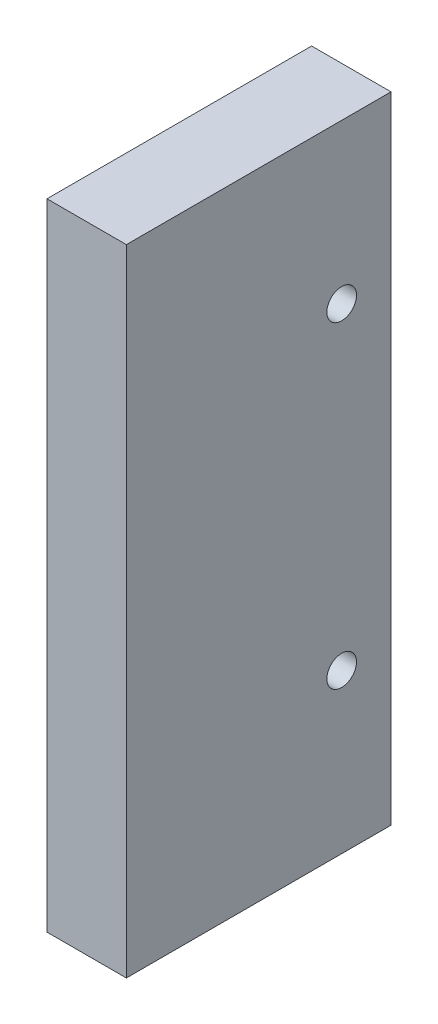
ISO-10303-21;
HEADER;
FILE_DESCRIPTION(('STEP AP214'),'2;1');
FILE_NAME('part.step','',(''),(''),'','','');
FILE_SCHEMA(('AUTOMOTIVE_DESIGN { 1 0 10303 214 1 1 1 1 }'));
ENDSEC;
DATA;
#1=APPLICATION_CONTEXT('core data for automotive mechanical design processes');
#2=APPLICATION_PROTOCOL_DEFINITION('international standard','automotive_design',2000,#1);
#3=PRODUCT_CONTEXT('',#1,'mechanical');
#4=PRODUCT('Part','Part','',(#3));
#5=PRODUCT_RELATED_PRODUCT_CATEGORY('part','',(#4));
#6=PRODUCT_DEFINITION_FORMATION('','',#4);
#7=PRODUCT_DEFINITION_CONTEXT('part definition',#1,'design');
#8=PRODUCT_DEFINITION('design','',#6,#7);
#9=PRODUCT_DEFINITION_SHAPE('','',#8);
#10=(LENGTH_UNIT() NAMED_UNIT(*) SI_UNIT(.MILLI.,.METRE.));
#11=(NAMED_UNIT(*) PLANE_ANGLE_UNIT() SI_UNIT($,.RADIAN.));
#12=(NAMED_UNIT(*) SI_UNIT($,.STERADIAN.) SOLID_ANGLE_UNIT());
#13=UNCERTAINTY_MEASURE_WITH_UNIT(LENGTH_MEASURE(1.E-05),#10,'distance_accuracy_value','');
#14=(GEOMETRIC_REPRESENTATION_CONTEXT(3) GLOBAL_UNCERTAINTY_ASSIGNED_CONTEXT((#13)) GLOBAL_UNIT_ASSIGNED_CONTEXT((#10,
#11,#12)) REPRESENTATION_CONTEXT('',''));
#15=CARTESIAN_POINT('',(0.,0.,0.));
#16=DIRECTION('',(0.,0.,1.));
#17=DIRECTION('',(1.,0.,0.));
#18=AXIS2_PLACEMENT_3D('',#15,#16,#17);
#19=CARTESIAN_POINT('',(0.,0.,31.75));
#20=DIRECTION('',(1.,0.,0.));
#21=DIRECTION('',(0.,0.,-1.));
#22=AXIS2_PLACEMENT_3D('',#19,#20,#21);
#23=PLANE('',#22);
#24=CARTESIAN_POINT('',(0.,19.05,5.91820000000001));
#25=DIRECTION('',(-1.,0.,0.));
#26=DIRECTION('',(0.,0.,1.));
#27=AXIS2_PLACEMENT_3D('',#24,#25,#26);
#28=CIRCLE('',#27,1.778);
#29=CARTESIAN_POINT('',(0.,19.05,7.69620000000001));
#30=VERTEX_POINT('',#29);
#31=EDGE_CURVE('E117',#30,#30,#28,.T.);
#32=ORIENTED_EDGE('',*,*,#31,.F.);
#33=EDGE_LOOP('',(#32));
#34=FACE_BOUND('',#33,.T.);
#35=CARTESIAN_POINT('',(0.,57.15,5.9182));
#36=DIRECTION('',(-1.,0.,0.));
#37=DIRECTION('',(0.,0.,1.));
#38=AXIS2_PLACEMENT_3D('',#35,#36,#37);
#39=CIRCLE('',#38,1.778);
#40=CARTESIAN_POINT('',(0.,57.15,7.6962));
#41=VERTEX_POINT('',#40);
#42=EDGE_CURVE('E111',#41,#41,#39,.T.);
#43=ORIENTED_EDGE('',*,*,#42,.F.);
#44=EDGE_LOOP('',(#43));
#45=FACE_BOUND('',#44,.T.);
#46=DIRECTION('',(0.,-1.,0.));
#47=VECTOR('',#46,1.);
#48=CARTESIAN_POINT('',(0.,0.,0.));
#49=LINE('',#48,#47);
#50=CARTESIAN_POINT('',(0.,76.2,0.));
#51=VERTEX_POINT('',#50);
#52=CARTESIAN_POINT('',(0.,0.,0.));
#53=VERTEX_POINT('',#52);
#54=EDGE_CURVE('E97',#51,#53,#49,.T.);
#55=ORIENTED_EDGE('',*,*,#54,.T.);
#56=DIRECTION('',(0.,0.,-1.));
#57=VECTOR('',#56,1.);
#58=CARTESIAN_POINT('',(0.,0.,31.75));
#59=LINE('',#58,#57);
#60=CARTESIAN_POINT('',(0.,0.,31.75));
#61=VERTEX_POINT('',#60);
#62=EDGE_CURVE('E11',#61,#53,#59,.T.);
#63=ORIENTED_EDGE('',*,*,#62,.F.);
#64=DIRECTION('',(0.,-1.,0.));
#65=VECTOR('',#64,1.);
#66=CARTESIAN_POINT('',(0.,0.,31.75));
#67=LINE('',#66,#65);
#68=CARTESIAN_POINT('',(0.,76.2,31.75));
#69=VERTEX_POINT('',#68);
#70=EDGE_CURVE('E85',#69,#61,#67,.T.);
#71=ORIENTED_EDGE('',*,*,#70,.F.);
#72=DIRECTION('',(0.,0.,-1.));
#73=VECTOR('',#72,1.);
#74=CARTESIAN_POINT('',(0.,76.2,31.75));
#75=LINE('',#74,#73);
#76=EDGE_CURVE('E93',#69,#51,#75,.T.);
#77=ORIENTED_EDGE('',*,*,#76,.T.);
#78=EDGE_LOOP('',(#55,#63,#71,#77));
#79=FACE_BOUND('',#78,.T.);
#80=ADVANCED_FACE('F34',(#34,#45,#79),#23,.F.);
#81=CARTESIAN_POINT('',(0.,0.,31.75));
#82=DIRECTION('',(0.,1.,0.));
#83=DIRECTION('',(0.,0.,1.));
#84=AXIS2_PLACEMENT_3D('',#81,#82,#83);
#85=PLANE('',#84);
#86=CARTESIAN_POINT('',(4.7625,0.,12.7));
#87=DIRECTION('',(0.,-1.,0.));
#88=DIRECTION('',(0.,0.,-1.));
#89=AXIS2_PLACEMENT_3D('',#86,#87,#88);
#90=CIRCLE('',#89,1.7272);
#91=CARTESIAN_POINT('',(4.7625,0.,10.9728));
#92=VERTEX_POINT('',#91);
#93=EDGE_CURVE('E129',#92,#92,#90,.T.);
#94=ORIENTED_EDGE('',*,*,#93,.F.);
#95=EDGE_LOOP('',(#94));
#96=FACE_BOUND('',#95,.T.);
#97=CARTESIAN_POINT('',(4.7625,0.,25.4));
#98=DIRECTION('',(0.,-1.,0.));
#99=DIRECTION('',(0.,0.,-1.));
#100=AXIS2_PLACEMENT_3D('',#97,#98,#99);
#101=CIRCLE('',#100,1.7272);
#102=CARTESIAN_POINT('',(4.7625,0.,23.6728));
#103=VERTEX_POINT('',#102);
#104=EDGE_CURVE('E123',#103,#103,#101,.T.);
#105=ORIENTED_EDGE('',*,*,#104,.F.);
#106=EDGE_LOOP('',(#105));
#107=FACE_BOUND('',#106,.T.);
#108=DIRECTION('',(1.,0.,0.));
#109=VECTOR('',#108,1.);
#110=CARTESIAN_POINT('',(0.,0.,0.));
#111=LINE('',#110,#109);
#112=CARTESIAN_POINT('',(9.52500000000001,0.,0.));
#113=VERTEX_POINT('',#112);
#114=EDGE_CURVE('E89',#53,#113,#111,.T.);
#115=ORIENTED_EDGE('',*,*,#114,.T.);
#116=DIRECTION('',(0.,0.,-1.));
#117=VECTOR('',#116,1.);
#118=CARTESIAN_POINT('',(9.52500000000001,0.,31.75));
#119=LINE('',#118,#117);
#120=CARTESIAN_POINT('',(9.52500000000001,0.,31.75));
#121=VERTEX_POINT('',#120);
#122=EDGE_CURVE('E42',#121,#113,#119,.T.);
#123=ORIENTED_EDGE('',*,*,#122,.F.);
#124=DIRECTION('',(1.,0.,0.));
#125=VECTOR('',#124,1.);
#126=CARTESIAN_POINT('',(0.,0.,31.75));
#127=LINE('',#126,#125);
#128=EDGE_CURVE('E80',#61,#121,#127,.T.);
#129=ORIENTED_EDGE('',*,*,#128,.F.);
#130=ORIENTED_EDGE('',*,*,#62,.T.);
#131=EDGE_LOOP('',(#115,#123,#129,#130));
#132=FACE_BOUND('',#131,.T.);
#133=ADVANCED_FACE('F88',(#96,#107,#132),#85,.F.);
#134=CARTESIAN_POINT('',(9.52500000000001,0.,31.75));
#135=DIRECTION('',(-1.,0.,0.));
#136=DIRECTION('',(0.,-1.,0.));
#137=AXIS2_PLACEMENT_3D('',#134,#135,#136);
#138=PLANE('',#137);
#139=CARTESIAN_POINT('',(9.52500000000001,19.05,5.91820000000001));
#140=DIRECTION('',(-1.,0.,0.));
#141=DIRECTION('',(0.,0.,1.));
#142=AXIS2_PLACEMENT_3D('',#139,#140,#141);
#143=CIRCLE('',#142,1.778);
#144=CARTESIAN_POINT('',(9.52500000000001,19.05,7.69620000000001));
#145=VERTEX_POINT('',#144);
#146=EDGE_CURVE('E114',#145,#145,#143,.T.);
#147=ORIENTED_EDGE('',*,*,#146,.T.);
#148=EDGE_LOOP('',(#147));
#149=FACE_BOUND('',#148,.T.);
#150=CARTESIAN_POINT('',(9.52500000000001,57.15,5.9182));
#151=DIRECTION('',(-1.,0.,0.));
#152=DIRECTION('',(0.,0.,1.));
#153=AXIS2_PLACEMENT_3D('',#150,#151,#152);
#154=CIRCLE('',#153,1.778);
#155=CARTESIAN_POINT('',(9.52500000000001,57.15,7.6962));
#156=VERTEX_POINT('',#155);
#157=EDGE_CURVE('E100',#156,#156,#154,.T.);
#158=ORIENTED_EDGE('',*,*,#157,.T.);
#159=EDGE_LOOP('',(#158));
#160=FACE_BOUND('',#159,.T.);
#161=DIRECTION('',(0.,1.,0.));
#162=VECTOR('',#161,1.);
#163=CARTESIAN_POINT('',(9.52500000000001,0.,0.));
#164=LINE('',#163,#162);
#165=CARTESIAN_POINT('',(9.525,76.2,0.));
#166=VERTEX_POINT('',#165);
#167=EDGE_CURVE('E67',#113,#166,#164,.T.);
#168=ORIENTED_EDGE('',*,*,#167,.T.);
#169=DIRECTION('',(0.,0.,-1.));
#170=VECTOR('',#169,1.);
#171=CARTESIAN_POINT('',(9.525,76.2,31.75));
#172=LINE('',#171,#170);
#173=CARTESIAN_POINT('',(9.525,76.2,31.75));
#174=VERTEX_POINT('',#173);
#175=EDGE_CURVE('E90',#174,#166,#172,.T.);
#176=ORIENTED_EDGE('',*,*,#175,.F.);
#177=DIRECTION('',(0.,1.,0.));
#178=VECTOR('',#177,1.);
#179=CARTESIAN_POINT('',(9.52500000000001,0.,31.75));
#180=LINE('',#179,#178);
#181=EDGE_CURVE('E83',#121,#174,#180,.T.);
#182=ORIENTED_EDGE('',*,*,#181,.F.);
#183=ORIENTED_EDGE('',*,*,#122,.T.);
#184=EDGE_LOOP('',(#168,#176,#182,#183));
#185=FACE_BOUND('',#184,.T.);
#186=ADVANCED_FACE('F91',(#149,#160,#185),#138,.F.);
#187=CARTESIAN_POINT('',(0.,76.2,31.75));
#188=DIRECTION('',(0.,-1.,0.));
#189=DIRECTION('',(0.,0.,-1.));
#190=AXIS2_PLACEMENT_3D('',#187,#188,#189);
#191=PLANE('',#190);
#192=DIRECTION('',(-1.,0.,0.));
#193=VECTOR('',#192,1.);
#194=CARTESIAN_POINT('',(0.,76.2,0.));
#195=LINE('',#194,#193);
#196=EDGE_CURVE('E73',#166,#51,#195,.T.);
#197=ORIENTED_EDGE('',*,*,#196,.T.);
#198=ORIENTED_EDGE('',*,*,#76,.F.);
#199=DIRECTION('',(-1.,0.,0.));
#200=VECTOR('',#199,1.);
#201=CARTESIAN_POINT('',(0.,76.2,31.75));
#202=LINE('',#201,#200);
#203=EDGE_CURVE('E50',#174,#69,#202,.T.);
#204=ORIENTED_EDGE('',*,*,#203,.F.);
#205=ORIENTED_EDGE('',*,*,#175,.T.);
#206=EDGE_LOOP('',(#197,#198,#204,#205));
#207=FACE_BOUND('',#206,.T.);
#208=ADVANCED_FACE('F105',(#207),#191,.F.);
#209=CARTESIAN_POINT('',(0.,0.,31.75));
#210=DIRECTION('',(0.,0.,-1.));
#211=DIRECTION('',(-1.,0.,0.));
#212=AXIS2_PLACEMENT_3D('',#209,#210,#211);
#213=PLANE('',#212);
#214=ORIENTED_EDGE('',*,*,#70,.T.);
#215=ORIENTED_EDGE('',*,*,#128,.T.);
#216=ORIENTED_EDGE('',*,*,#181,.T.);
#217=ORIENTED_EDGE('',*,*,#203,.T.);
#218=EDGE_LOOP('',(#214,#215,#216,#217));
#219=FACE_BOUND('',#218,.T.);
#220=ADVANCED_FACE('F81',(#219),#213,.F.);
#221=CARTESIAN_POINT('',(0.,0.,0.));
#222=DIRECTION('',(0.,0.,-1.));
#223=DIRECTION('',(-1.,0.,0.));
#224=AXIS2_PLACEMENT_3D('',#221,#222,#223);
#225=PLANE('',#224);
#226=ORIENTED_EDGE('',*,*,#54,.F.);
#227=ORIENTED_EDGE('',*,*,#196,.F.);
#228=ORIENTED_EDGE('',*,*,#167,.F.);
#229=ORIENTED_EDGE('',*,*,#114,.F.);
#230=EDGE_LOOP('',(#226,#227,#228,#229));
#231=FACE_BOUND('',#230,.T.);
#232=ADVANCED_FACE('F108',(#231),#225,.T.);
#233=CARTESIAN_POINT('',(9.52500000000001,57.15,5.9182));
#234=DIRECTION('',(-1.,0.,0.));
#235=DIRECTION('',(0.,0.,1.));
#236=AXIS2_PLACEMENT_3D('',#233,#234,#235);
#237=CYLINDRICAL_SURFACE('',#236,1.778);
#238=ORIENTED_EDGE('',*,*,#157,.F.);
#239=EDGE_LOOP('',(#238));
#240=FACE_BOUND('',#239,.T.);
#241=ORIENTED_EDGE('',*,*,#42,.T.);
#242=EDGE_LOOP('',(#241));
#243=FACE_BOUND('',#242,.T.);
#244=ADVANCED_FACE('F159',(#240,#243),#237,.F.);
#245=CARTESIAN_POINT('',(9.52500000000001,19.05,5.91820000000001));
#246=DIRECTION('',(-1.,0.,0.));
#247=DIRECTION('',(0.,0.,1.));
#248=AXIS2_PLACEMENT_3D('',#245,#246,#247);
#249=CYLINDRICAL_SURFACE('',#248,1.778);
#250=ORIENTED_EDGE('',*,*,#146,.F.);
#251=EDGE_LOOP('',(#250));
#252=FACE_BOUND('',#251,.T.);
#253=ORIENTED_EDGE('',*,*,#31,.T.);
#254=EDGE_LOOP('',(#253));
#255=FACE_BOUND('',#254,.T.);
#256=ADVANCED_FACE('F150',(#252,#255),#249,.F.);
#257=CARTESIAN_POINT('',(4.7625,19.05,25.4));
#258=DIRECTION('',(0.,-1.,0.));
#259=DIRECTION('',(0.,0.,-1.));
#260=AXIS2_PLACEMENT_3D('',#257,#258,#259);
#261=CYLINDRICAL_SURFACE('',#260,1.7272);
#262=CARTESIAN_POINT('',(4.7625,19.05,25.4));
#263=DIRECTION('',(0.,-1.,0.));
#264=DIRECTION('',(0.,0.,-1.));
#265=AXIS2_PLACEMENT_3D('',#262,#263,#264);
#266=CIRCLE('',#265,1.7272);
#267=CARTESIAN_POINT('',(4.7625,19.05,23.6728));
#268=VERTEX_POINT('',#267);
#269=EDGE_CURVE('E120',#268,#268,#266,.T.);
#270=ORIENTED_EDGE('',*,*,#269,.F.);
#271=EDGE_LOOP('',(#270));
#272=FACE_BOUND('',#271,.T.);
#273=ORIENTED_EDGE('',*,*,#104,.T.);
#274=EDGE_LOOP('',(#273));
#275=FACE_BOUND('',#274,.T.);
#276=ADVANCED_FACE('F148',(#272,#275),#261,.F.);
#277=CARTESIAN_POINT('',(4.7625,19.05,25.4));
#278=DIRECTION('',(0.,-1.,0.));
#279=DIRECTION('',(0.,0.,-1.));
#280=AXIS2_PLACEMENT_3D('',#277,#278,#279);
#281=PLANE('',#280);
#282=ORIENTED_EDGE('',*,*,#269,.T.);
#283=EDGE_LOOP('',(#282));
#284=FACE_BOUND('',#283,.T.);
#285=ADVANCED_FACE('F140',(#284),#281,.T.);
#286=CARTESIAN_POINT('',(4.7625,19.05,12.7));
#287=DIRECTION('',(0.,-1.,0.));
#288=DIRECTION('',(0.,0.,-1.));
#289=AXIS2_PLACEMENT_3D('',#286,#287,#288);
#290=CYLINDRICAL_SURFACE('',#289,1.7272);
#291=CARTESIAN_POINT('',(4.7625,19.05,12.7));
#292=DIRECTION('',(0.,-1.,0.));
#293=DIRECTION('',(0.,0.,-1.));
#294=AXIS2_PLACEMENT_3D('',#291,#292,#293);
#295=CIRCLE('',#294,1.7272);
#296=CARTESIAN_POINT('',(4.7625,19.05,10.9728));
#297=VERTEX_POINT('',#296);
#298=EDGE_CURVE('E126',#297,#297,#295,.T.);
#299=ORIENTED_EDGE('',*,*,#298,.F.);
#300=EDGE_LOOP('',(#299));
#301=FACE_BOUND('',#300,.T.);
#302=ORIENTED_EDGE('',*,*,#93,.T.);
#303=EDGE_LOOP('',(#302));
#304=FACE_BOUND('',#303,.T.);
#305=ADVANCED_FACE('F137',(#301,#304),#290,.F.);
#306=CARTESIAN_POINT('',(4.7625,19.05,12.7));
#307=DIRECTION('',(0.,-1.,0.));
#308=DIRECTION('',(0.,0.,-1.));
#309=AXIS2_PLACEMENT_3D('',#306,#307,#308);
#310=PLANE('',#309);
#311=ORIENTED_EDGE('',*,*,#298,.T.);
#312=EDGE_LOOP('',(#311));
#313=FACE_BOUND('',#312,.T.);
#314=ADVANCED_FACE('F135',(#313),#310,.T.);
#315=CLOSED_SHELL('',(#80,#133,#186,#208,#220,#232,#244,#256,#276,#285,#305,#314));
#316=MANIFOLD_SOLID_BREP('B2',#315);
#317=ADVANCED_BREP_SHAPE_REPRESENTATION('',(#18,#316),#14);
#318=SHAPE_DEFINITION_REPRESENTATION(#9,#317);
ENDSEC;
END-ISO-10303-21;
